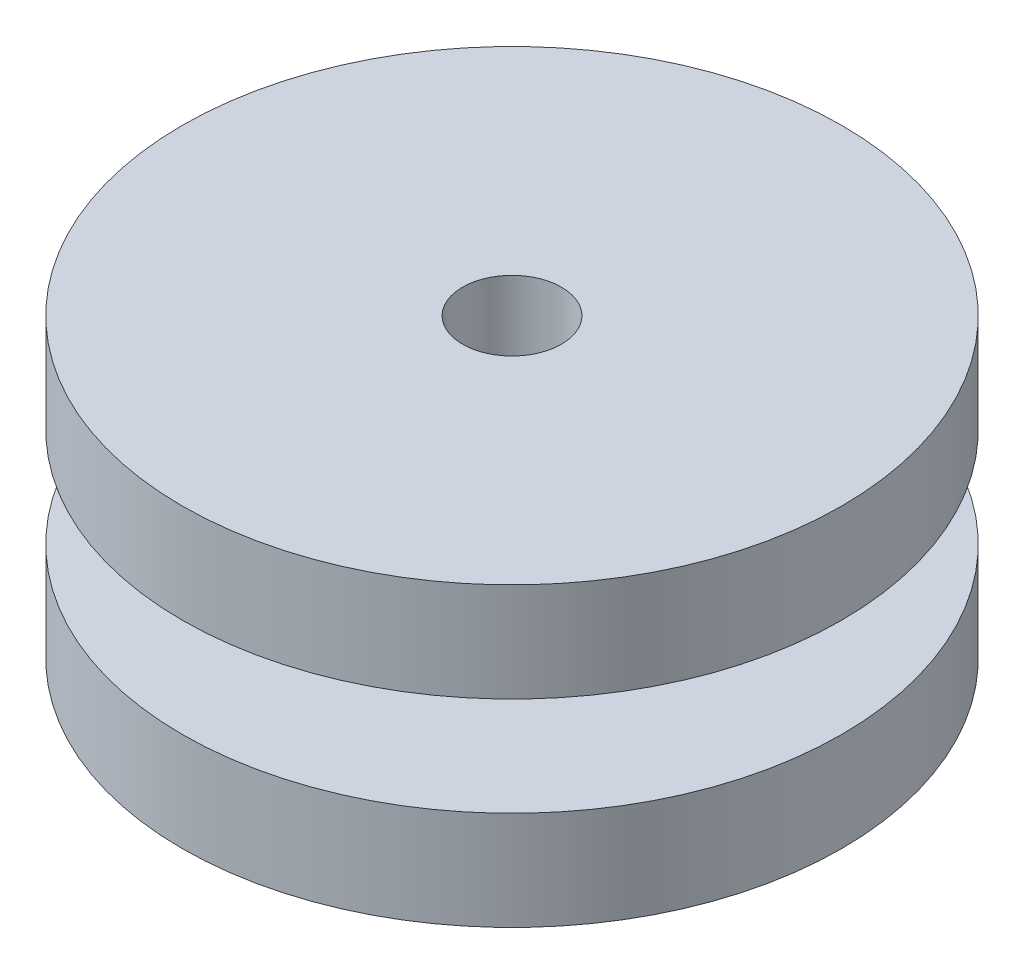
ISO-10303-21;
HEADER;
FILE_DESCRIPTION(('STEP AP214'),'2;1');
FILE_NAME('part.step','',(''),(''),'','','');
FILE_SCHEMA(('AUTOMOTIVE_DESIGN { 1 0 10303 214 1 1 1 1 }'));
ENDSEC;
DATA;
#1=APPLICATION_CONTEXT('core data for automotive mechanical design processes');
#2=APPLICATION_PROTOCOL_DEFINITION('international standard','automotive_design',2000,#1);
#3=PRODUCT_CONTEXT('',#1,'mechanical');
#4=PRODUCT('Part','Part','',(#3));
#5=PRODUCT_RELATED_PRODUCT_CATEGORY('part','',(#4));
#6=PRODUCT_DEFINITION_FORMATION('','',#4);
#7=PRODUCT_DEFINITION_CONTEXT('part definition',#1,'design');
#8=PRODUCT_DEFINITION('design','',#6,#7);
#9=PRODUCT_DEFINITION_SHAPE('','',#8);
#10=(LENGTH_UNIT() NAMED_UNIT(*) SI_UNIT(.MILLI.,.METRE.));
#11=(NAMED_UNIT(*) PLANE_ANGLE_UNIT() SI_UNIT($,.RADIAN.));
#12=(NAMED_UNIT(*) SI_UNIT($,.STERADIAN.) SOLID_ANGLE_UNIT());
#13=UNCERTAINTY_MEASURE_WITH_UNIT(LENGTH_MEASURE(1.E-05),#10,'distance_accuracy_value','');
#14=(GEOMETRIC_REPRESENTATION_CONTEXT(3) GLOBAL_UNCERTAINTY_ASSIGNED_CONTEXT((#13)) GLOBAL_UNIT_ASSIGNED_CONTEXT((#10,
#11,#12)) REPRESENTATION_CONTEXT('',''));
#15=CARTESIAN_POINT('',(0.,0.,0.));
#16=DIRECTION('',(0.,0.,1.));
#17=DIRECTION('',(1.,0.,0.));
#18=AXIS2_PLACEMENT_3D('',#15,#16,#17);
#19=CARTESIAN_POINT('',(0.,9.,0.));
#20=DIRECTION('',(0.,-1.,0.));
#21=DIRECTION('',(0.,0.,1.));
#22=AXIS2_PLACEMENT_3D('',#19,#20,#21);
#23=CYLINDRICAL_SURFACE('',#22,3.5);
#24=CARTESIAN_POINT('',(0.,4.,0.));
#25=DIRECTION('',(0.,1.,0.));
#26=DIRECTION('',(0.,0.,1.));
#27=AXIS2_PLACEMENT_3D('',#24,#25,#26);
#28=CIRCLE('',#27,3.5);
#29=CARTESIAN_POINT('',(0.,4.,3.5));
#30=VERTEX_POINT('',#29);
#31=EDGE_CURVE('E46',#30,#30,#28,.F.);
#32=ORIENTED_EDGE('',*,*,#31,.F.);
#33=EDGE_LOOP('',(#32));
#34=FACE_BOUND('',#33,.T.);
#35=CARTESIAN_POINT('',(0.,5.,0.));
#36=DIRECTION('',(0.,-1.,0.));
#37=DIRECTION('',(0.,0.,-1.));
#38=AXIS2_PLACEMENT_3D('',#35,#36,#37);
#39=CIRCLE('',#38,3.5);
#40=CARTESIAN_POINT('',(0.,5.,-3.5));
#41=VERTEX_POINT('',#40);
#42=EDGE_CURVE('E50',#41,#41,#39,.F.);
#43=ORIENTED_EDGE('',*,*,#42,.F.);
#44=EDGE_LOOP('',(#43));
#45=FACE_BOUND('',#44,.T.);
#46=ADVANCED_FACE('F39',(#34,#45),#23,.T.);
#47=CARTESIAN_POINT('',(0.,9.,0.));
#48=DIRECTION('',(0.,1.,0.));
#49=DIRECTION('',(0.,0.,-1.));
#50=AXIS2_PLACEMENT_3D('',#47,#48,#49);
#51=PLANE('',#50);
#52=CARTESIAN_POINT('',(0.,9.,0.));
#53=DIRECTION('',(0.,-1.,0.));
#54=DIRECTION('',(0.,0.,-1.));
#55=AXIS2_PLACEMENT_3D('',#52,#53,#54);
#56=CIRCLE('',#55,1.5);
#57=CARTESIAN_POINT('',(0.,9.,-1.5));
#58=VERTEX_POINT('',#57);
#59=EDGE_CURVE('E59',#58,#58,#56,.T.);
#60=ORIENTED_EDGE('',*,*,#59,.T.);
#61=EDGE_LOOP('',(#60));
#62=FACE_BOUND('',#61,.T.);
#63=CARTESIAN_POINT('',(0.,9.,0.));
#64=DIRECTION('',(0.,-1.,0.));
#65=DIRECTION('',(0.,0.,-1.));
#66=AXIS2_PLACEMENT_3D('',#63,#64,#65);
#67=CIRCLE('',#66,10.);
#68=CARTESIAN_POINT('',(0.,9.,-10.));
#69=VERTEX_POINT('',#68);
#70=EDGE_CURVE('E72',#69,#69,#67,.T.);
#71=ORIENTED_EDGE('',*,*,#70,.F.);
#72=EDGE_LOOP('',(#71));
#73=FACE_BOUND('',#72,.T.);
#74=ADVANCED_FACE('F87',(#62,#73),#51,.T.);
#75=CARTESIAN_POINT('',(0.,0.,0.));
#76=DIRECTION('',(0.,1.,0.));
#77=DIRECTION('',(0.,0.,-1.));
#78=AXIS2_PLACEMENT_3D('',#75,#76,#77);
#79=PLANE('',#78);
#80=CARTESIAN_POINT('',(0.,0.,0.));
#81=DIRECTION('',(0.,-1.,0.));
#82=DIRECTION('',(0.,0.,-1.));
#83=AXIS2_PLACEMENT_3D('',#80,#81,#82);
#84=CIRCLE('',#83,1.5);
#85=CARTESIAN_POINT('',(0.,0.,-1.5));
#86=VERTEX_POINT('',#85);
#87=EDGE_CURVE('E60',#86,#86,#84,.T.);
#88=ORIENTED_EDGE('',*,*,#87,.F.);
#89=EDGE_LOOP('',(#88));
#90=FACE_BOUND('',#89,.T.);
#91=CARTESIAN_POINT('',(0.,0.,0.));
#92=DIRECTION('',(0.,1.,0.));
#93=DIRECTION('',(0.,0.,1.));
#94=AXIS2_PLACEMENT_3D('',#91,#92,#93);
#95=CIRCLE('',#94,10.);
#96=CARTESIAN_POINT('',(0.,0.,10.));
#97=VERTEX_POINT('',#96);
#98=EDGE_CURVE('E66',#97,#97,#95,.T.);
#99=ORIENTED_EDGE('',*,*,#98,.F.);
#100=EDGE_LOOP('',(#99));
#101=FACE_BOUND('',#100,.T.);
#102=ADVANCED_FACE('F89',(#90,#101),#79,.F.);
#103=CARTESIAN_POINT('',(0.,9.,0.));
#104=DIRECTION('',(0.,-1.,0.));
#105=DIRECTION('',(0.,0.,1.));
#106=AXIS2_PLACEMENT_3D('',#103,#104,#105);
#107=CYLINDRICAL_SURFACE('',#106,1.5);
#108=ORIENTED_EDGE('',*,*,#59,.F.);
#109=EDGE_LOOP('',(#108));
#110=FACE_BOUND('',#109,.T.);
#111=ORIENTED_EDGE('',*,*,#87,.T.);
#112=EDGE_LOOP('',(#111));
#113=FACE_BOUND('',#112,.T.);
#114=ADVANCED_FACE('F96',(#110,#113),#107,.F.);
#115=CARTESIAN_POINT('',(0.,6.,0.));
#116=DIRECTION('',(0.,1.,0.));
#117=DIRECTION('',(0.,0.,-1.));
#118=AXIS2_PLACEMENT_3D('',#115,#116,#117);
#119=PLANE('',#118);
#120=CARTESIAN_POINT('',(0.,6.,0.));
#121=DIRECTION('',(0.,-1.,0.));
#122=DIRECTION('',(0.,0.,-1.));
#123=AXIS2_PLACEMENT_3D('',#120,#121,#122);
#124=CIRCLE('',#123,4.5);
#125=CARTESIAN_POINT('',(0.,6.,-4.5));
#126=VERTEX_POINT('',#125);
#127=EDGE_CURVE('E10',#126,#126,#124,.T.);
#128=ORIENTED_EDGE('',*,*,#127,.F.);
#129=EDGE_LOOP('',(#128));
#130=FACE_BOUND('',#129,.T.);
#131=CARTESIAN_POINT('',(0.,6.,0.));
#132=DIRECTION('',(0.,-1.,0.));
#133=DIRECTION('',(0.,0.,-1.));
#134=AXIS2_PLACEMENT_3D('',#131,#132,#133);
#135=CIRCLE('',#134,10.);
#136=CARTESIAN_POINT('',(0.,6.,-10.));
#137=VERTEX_POINT('',#136);
#138=EDGE_CURVE('E69',#137,#137,#135,.T.);
#139=ORIENTED_EDGE('',*,*,#138,.T.);
#140=EDGE_LOOP('',(#139));
#141=FACE_BOUND('',#140,.T.);
#142=ADVANCED_FACE('F78',(#130,#141),#119,.F.);
#143=CARTESIAN_POINT('',(0.,3.,0.));
#144=DIRECTION('',(0.,-1.,0.));
#145=DIRECTION('',(0.,0.,1.));
#146=AXIS2_PLACEMENT_3D('',#143,#144,#145);
#147=PLANE('',#146);
#148=CARTESIAN_POINT('',(0.,3.,0.));
#149=DIRECTION('',(0.,1.,0.));
#150=DIRECTION('',(0.,0.,1.));
#151=AXIS2_PLACEMENT_3D('',#148,#149,#150);
#152=CIRCLE('',#151,4.5);
#153=CARTESIAN_POINT('',(0.,3.,4.5));
#154=VERTEX_POINT('',#153);
#155=EDGE_CURVE('E54',#154,#154,#152,.T.);
#156=ORIENTED_EDGE('',*,*,#155,.F.);
#157=EDGE_LOOP('',(#156));
#158=FACE_BOUND('',#157,.T.);
#159=CARTESIAN_POINT('',(0.,3.,0.));
#160=DIRECTION('',(0.,1.,0.));
#161=DIRECTION('',(0.,0.,1.));
#162=AXIS2_PLACEMENT_3D('',#159,#160,#161);
#163=CIRCLE('',#162,10.);
#164=CARTESIAN_POINT('',(0.,3.,10.));
#165=VERTEX_POINT('',#164);
#166=EDGE_CURVE('E63',#165,#165,#163,.T.);
#167=ORIENTED_EDGE('',*,*,#166,.T.);
#168=EDGE_LOOP('',(#167));
#169=FACE_BOUND('',#168,.T.);
#170=ADVANCED_FACE('F105',(#158,#169),#147,.F.);
#171=CARTESIAN_POINT('',(0.,4.,0.));
#172=DIRECTION('',(0.,-1.,0.));
#173=DIRECTION('',(0.,0.,1.));
#174=AXIS2_PLACEMENT_3D('',#171,#172,#173);
#175=TOROIDAL_SURFACE('',#174,4.5,1.);
#176=ORIENTED_EDGE('',*,*,#31,.T.);
#177=EDGE_LOOP('',(#176));
#178=FACE_BOUND('',#177,.T.);
#179=ORIENTED_EDGE('',*,*,#155,.T.);
#180=EDGE_LOOP('',(#179));
#181=FACE_BOUND('',#180,.T.);
#182=ADVANCED_FACE('F103',(#178,#181),#175,.F.);
#183=CARTESIAN_POINT('',(0.,5.,0.));
#184=DIRECTION('',(0.,1.,0.));
#185=DIRECTION('',(0.,0.,-1.));
#186=AXIS2_PLACEMENT_3D('',#183,#184,#185);
#187=TOROIDAL_SURFACE('',#186,4.5,1.);
#188=ORIENTED_EDGE('',*,*,#42,.T.);
#189=EDGE_LOOP('',(#188));
#190=FACE_BOUND('',#189,.T.);
#191=ORIENTED_EDGE('',*,*,#127,.T.);
#192=EDGE_LOOP('',(#191));
#193=FACE_BOUND('',#192,.T.);
#194=ADVANCED_FACE('F41',(#190,#193),#187,.F.);
#195=CARTESIAN_POINT('',(0.,3.,0.));
#196=DIRECTION('',(0.,-1.,0.));
#197=DIRECTION('',(0.,0.,1.));
#198=AXIS2_PLACEMENT_3D('',#195,#196,#197);
#199=CYLINDRICAL_SURFACE('',#198,10.);
#200=ORIENTED_EDGE('',*,*,#166,.F.);
#201=EDGE_LOOP('',(#200));
#202=FACE_BOUND('',#201,.T.);
#203=ORIENTED_EDGE('',*,*,#98,.T.);
#204=EDGE_LOOP('',(#203));
#205=FACE_BOUND('',#204,.T.);
#206=ADVANCED_FACE('F83',(#202,#205),#199,.T.);
#207=CARTESIAN_POINT('',(0.,6.,0.));
#208=DIRECTION('',(0.,1.,0.));
#209=DIRECTION('',(0.,0.,-1.));
#210=AXIS2_PLACEMENT_3D('',#207,#208,#209);
#211=CYLINDRICAL_SURFACE('',#210,10.);
#212=ORIENTED_EDGE('',*,*,#138,.F.);
#213=EDGE_LOOP('',(#212));
#214=FACE_BOUND('',#213,.T.);
#215=ORIENTED_EDGE('',*,*,#70,.T.);
#216=EDGE_LOOP('',(#215));
#217=FACE_BOUND('',#216,.T.);
#218=ADVANCED_FACE('F80',(#214,#217),#211,.T.);
#219=CLOSED_SHELL('',(#46,#74,#102,#114,#142,#170,#182,#194,#206,#218));
#220=MANIFOLD_SOLID_BREP('B2',#219);
#221=ADVANCED_BREP_SHAPE_REPRESENTATION('',(#18,#220),#14);
#222=SHAPE_DEFINITION_REPRESENTATION(#9,#221);
ENDSEC;
END-ISO-10303-21;
